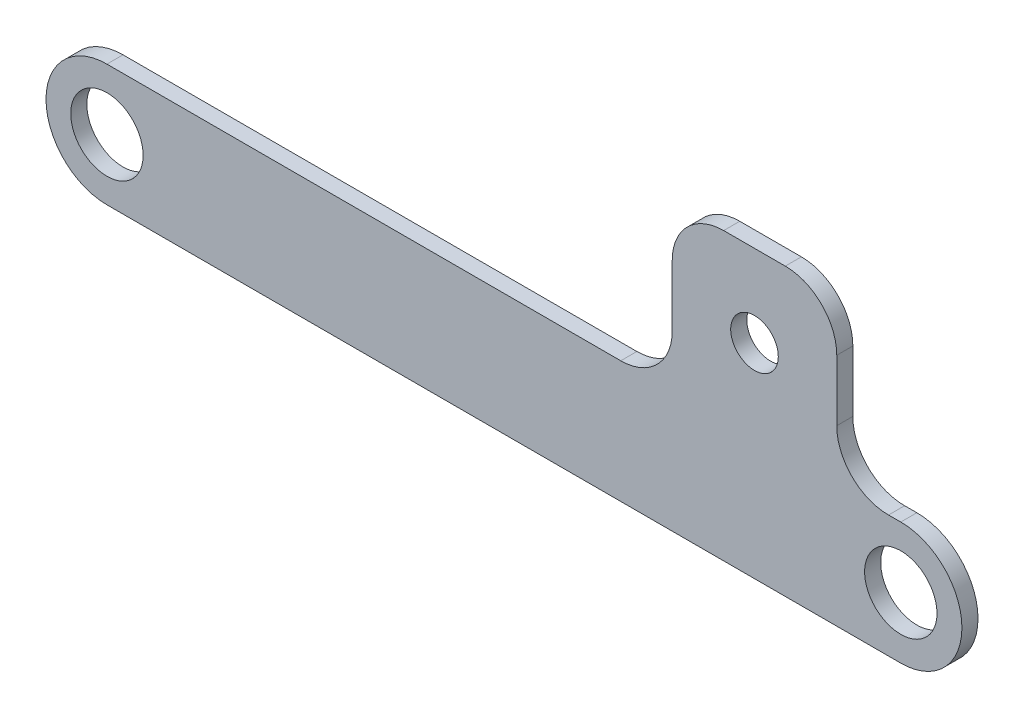
ISO-10303-21;
HEADER;
FILE_DESCRIPTION(('STEP AP214'),'2;1');
FILE_NAME('part.step','',(''),(''),'','','');
FILE_SCHEMA(('AUTOMOTIVE_DESIGN { 1 0 10303 214 1 1 1 1 }'));
ENDSEC;
DATA;
#1=APPLICATION_CONTEXT('core data for automotive mechanical design processes');
#2=APPLICATION_PROTOCOL_DEFINITION('international standard','automotive_design',2000,#1);
#3=PRODUCT_CONTEXT('',#1,'mechanical');
#4=PRODUCT('Part','Part','',(#3));
#5=PRODUCT_RELATED_PRODUCT_CATEGORY('part','',(#4));
#6=PRODUCT_DEFINITION_FORMATION('','',#4);
#7=PRODUCT_DEFINITION_CONTEXT('part definition',#1,'design');
#8=PRODUCT_DEFINITION('design','',#6,#7);
#9=PRODUCT_DEFINITION_SHAPE('','',#8);
#10=(LENGTH_UNIT() NAMED_UNIT(*) SI_UNIT(.MILLI.,.METRE.));
#11=(NAMED_UNIT(*) PLANE_ANGLE_UNIT() SI_UNIT($,.RADIAN.));
#12=(NAMED_UNIT(*) SI_UNIT($,.STERADIAN.) SOLID_ANGLE_UNIT());
#13=UNCERTAINTY_MEASURE_WITH_UNIT(LENGTH_MEASURE(1.E-05),#10,'distance_accuracy_value','');
#14=(GEOMETRIC_REPRESENTATION_CONTEXT(3) GLOBAL_UNCERTAINTY_ASSIGNED_CONTEXT((#13)) GLOBAL_UNIT_ASSIGNED_CONTEXT((#10,
#11,#12)) REPRESENTATION_CONTEXT('',''));
#15=CARTESIAN_POINT('',(0.,0.,0.));
#16=DIRECTION('',(0.,0.,1.));
#17=DIRECTION('',(1.,0.,0.));
#18=AXIS2_PLACEMENT_3D('',#15,#16,#17);
#19=CARTESIAN_POINT('',(0.,0.,6.35));
#20=DIRECTION('',(0.,0.,1.));
#21=DIRECTION('',(1.,0.,0.));
#22=AXIS2_PLACEMENT_3D('',#19,#20,#21);
#23=PLANE('',#22);
#24=CARTESIAN_POINT('',(-57.7648589463848,56.47830208,6.35));
#25=DIRECTION('',(0.,0.,1.));
#26=DIRECTION('',(1.,0.,0.));
#27=AXIS2_PLACEMENT_3D('',#24,#25,#26);
#28=CIRCLE('',#27,9.39800000000001);
#29=CARTESIAN_POINT('',(-48.3668589463848,56.47830208,6.35));
#30=VERTEX_POINT('',#29);
#31=EDGE_CURVE('E418',#30,#30,#28,.T.);
#32=ORIENTED_EDGE('',*,*,#31,.F.);
#33=EDGE_LOOP('',(#32));
#34=FACE_BOUND('',#33,.T.);
#35=DIRECTION('',(-1.,0.,0.));
#36=VECTOR('',#35,1.);
#37=CARTESIAN_POINT('',(-90.24339584,88.82660416,6.35));
#38=LINE('',#37,#36);
#39=CARTESIAN_POINT('',(-45.6063221763848,88.82660416,6.35));
#40=VERTEX_POINT('',#39);
#41=CARTESIAN_POINT('',(-69.92339584,88.82660416,6.35));
#42=VERTEX_POINT('',#41);
#43=EDGE_CURVE('E245',#40,#42,#38,.T.);
#44=ORIENTED_EDGE('',*,*,#43,.T.);
#45=CARTESIAN_POINT('',(-69.92339584,68.50660416,6.35));
#46=DIRECTION('',(0.,0.,1.));
#47=DIRECTION('',(1.,0.,0.));
#48=AXIS2_PLACEMENT_3D('',#45,#46,#47);
#49=CIRCLE('',#48,20.32);
#50=CARTESIAN_POINT('',(-90.24339584,68.50660416,6.35));
#51=VERTEX_POINT('',#50);
#52=EDGE_CURVE('E11',#42,#51,#49,.T.);
#53=ORIENTED_EDGE('',*,*,#52,.T.);
#54=DIRECTION('',(0.,-1.,0.));
#55=VECTOR('',#54,1.);
#56=CARTESIAN_POINT('',(-90.24339584,88.82660416,6.35));
#57=LINE('',#56,#55);
#58=CARTESIAN_POINT('',(-90.24339584,44.30320832,6.35));
#59=VERTEX_POINT('',#58);
#60=EDGE_CURVE('E197',#51,#59,#57,.T.);
#61=ORIENTED_EDGE('',*,*,#60,.T.);
#62=CARTESIAN_POINT('',(-110.56339584,44.30320832,6.35));
#63=DIRECTION('',(0.,0.,1.));
#64=DIRECTION('',(1.,0.,0.));
#65=AXIS2_PLACEMENT_3D('',#62,#63,#64);
#66=CIRCLE('',#65,20.32);
#67=CARTESIAN_POINT('',(-110.56339584,23.98320832,6.35));
#68=VERTEX_POINT('',#67);
#69=EDGE_CURVE('E170',#59,#68,#66,.F.);
#70=ORIENTED_EDGE('',*,*,#69,.T.);
#71=DIRECTION('',(-1.,0.,0.));
#72=VECTOR('',#71,1.);
#73=CARTESIAN_POINT('',(-90.24339584,23.98320832,6.35));
#74=LINE('',#73,#72);
#75=CARTESIAN_POINT('',(-313.436,23.98320832,6.35));
#76=VERTEX_POINT('',#75);
#77=EDGE_CURVE('E248',#68,#76,#74,.T.);
#78=ORIENTED_EDGE('',*,*,#77,.T.);
#79=CARTESIAN_POINT('',(-313.436,-0.0733958400000374,6.35));
#80=DIRECTION('',(0.,0.,1.));
#81=DIRECTION('',(-1.,0.,0.));
#82=AXIS2_PLACEMENT_3D('',#79,#80,#81);
#83=CIRCLE('',#82,24.05660416);
#84=CARTESIAN_POINT('',(-313.436,-24.13,6.35));
#85=VERTEX_POINT('',#84);
#86=EDGE_CURVE('E252',#76,#85,#83,.T.);
#87=ORIENTED_EDGE('',*,*,#86,.T.);
#88=DIRECTION('',(1.,0.,0.));
#89=VECTOR('',#88,1.);
#90=CARTESIAN_POINT('',(0.,-24.13,6.35));
#91=LINE('',#90,#89);
#92=CARTESIAN_POINT('',(0.,-24.13,6.35));
#93=VERTEX_POINT('',#92);
#94=EDGE_CURVE('E145',#85,#93,#91,.T.);
#95=ORIENTED_EDGE('',*,*,#94,.T.);
#96=CARTESIAN_POINT('',(0.,0.,6.35));
#97=DIRECTION('',(0.,0.,1.));
#98=DIRECTION('',(1.,0.,0.));
#99=AXIS2_PLACEMENT_3D('',#96,#97,#98);
#100=CIRCLE('',#99,24.13);
#101=CARTESIAN_POINT('',(-1.74409034865255E-13,24.13,6.35));
#102=VERTEX_POINT('',#101);
#103=EDGE_CURVE('E140',#93,#102,#100,.T.);
#104=ORIENTED_EDGE('',*,*,#103,.T.);
#105=DIRECTION('',(-0.999983150361978,-0.00580508330113796,0.));
#106=VECTOR('',#105,1.);
#107=CARTESIAN_POINT('',(-25.2863221763848,23.98320832,6.35));
#108=LINE('',#107,#106);
#109=CARTESIAN_POINT('',(-4.8483628837057,24.1018543753424,6.35));
#110=VERTEX_POINT('',#109);
#111=EDGE_CURVE('E128',#102,#110,#108,.T.);
#112=ORIENTED_EDGE('',*,*,#111,.T.);
#113=CARTESIAN_POINT('',(-4.96632217638484,44.4215119906978,6.35));
#114=DIRECTION('',(0.,0.,1.));
#115=DIRECTION('',(1.,0.,0.));
#116=AXIS2_PLACEMENT_3D('',#113,#114,#115);
#117=CIRCLE('',#116,20.32);
#118=CARTESIAN_POINT('',(-25.2863221763848,44.4215119906978,6.35));
#119=VERTEX_POINT('',#118);
#120=EDGE_CURVE('E178',#110,#119,#117,.F.);
#121=ORIENTED_EDGE('',*,*,#120,.T.);
#122=DIRECTION('',(0.,1.,0.));
#123=VECTOR('',#122,1.);
#124=CARTESIAN_POINT('',(-25.2863221763848,88.82660416,6.35));
#125=LINE('',#124,#123);
#126=CARTESIAN_POINT('',(-25.2863221763848,68.50660416,6.35));
#127=VERTEX_POINT('',#126);
#128=EDGE_CURVE('E139',#119,#127,#125,.T.);
#129=ORIENTED_EDGE('',*,*,#128,.T.);
#130=CARTESIAN_POINT('',(-45.6063221763848,68.50660416,6.35));
#131=DIRECTION('',(0.,0.,1.));
#132=DIRECTION('',(1.,0.,0.));
#133=AXIS2_PLACEMENT_3D('',#130,#131,#132);
#134=CIRCLE('',#133,20.32);
#135=EDGE_CURVE('E187',#127,#40,#134,.T.);
#136=ORIENTED_EDGE('',*,*,#135,.T.);
#137=EDGE_LOOP('',(#44,#53,#61,#70,#78,#87,#95,#104,#112,#121,#129,#136));
#138=FACE_BOUND('',#137,.T.);
#139=CARTESIAN_POINT('',(-313.436,-0.0733958400000374,6.35));
#140=DIRECTION('',(0.,0.,1.));
#141=DIRECTION('',(1.,0.,0.));
#142=AXIS2_PLACEMENT_3D('',#139,#140,#141);
#143=CIRCLE('',#142,14.2875);
#144=CARTESIAN_POINT('',(-299.1485,-0.0733958400000374,6.35));
#145=VERTEX_POINT('',#144);
#146=EDGE_CURVE('E225',#145,#145,#143,.T.);
#147=ORIENTED_EDGE('',*,*,#146,.F.);
#148=EDGE_LOOP('',(#147));
#149=FACE_BOUND('',#148,.T.);
#150=CARTESIAN_POINT('',(0.,0.,6.35));
#151=DIRECTION('',(0.,0.,1.));
#152=DIRECTION('',(1.,0.,0.));
#153=AXIS2_PLACEMENT_3D('',#150,#151,#152);
#154=CIRCLE('',#153,14.2875);
#155=CARTESIAN_POINT('',(14.2875,0.,6.35));
#156=VERTEX_POINT('',#155);
#157=EDGE_CURVE('E409',#156,#156,#154,.T.);
#158=ORIENTED_EDGE('',*,*,#157,.F.);
#159=EDGE_LOOP('',(#158));
#160=FACE_BOUND('',#159,.T.);
#161=ADVANCED_FACE('F39',(#34,#138,#149,#160),#23,.T.);
#162=CARTESIAN_POINT('',(0.,0.,0.));
#163=DIRECTION('',(0.,0.,1.));
#164=DIRECTION('',(1.,0.,0.));
#165=AXIS2_PLACEMENT_3D('',#162,#163,#164);
#166=PLANE('',#165);
#167=DIRECTION('',(0.,-1.,0.));
#168=VECTOR('',#167,1.);
#169=CARTESIAN_POINT('',(-90.24339584,88.82660416,0.));
#170=LINE('',#169,#168);
#171=CARTESIAN_POINT('',(-90.24339584,68.50660416,0.));
#172=VERTEX_POINT('',#171);
#173=CARTESIAN_POINT('',(-90.24339584,44.30320832,0.));
#174=VERTEX_POINT('',#173);
#175=EDGE_CURVE('E196',#172,#174,#170,.T.);
#176=ORIENTED_EDGE('',*,*,#175,.F.);
#177=CARTESIAN_POINT('',(-69.92339584,68.50660416,0.));
#178=DIRECTION('',(0.,0.,1.));
#179=DIRECTION('',(1.,0.,0.));
#180=AXIS2_PLACEMENT_3D('',#177,#178,#179);
#181=CIRCLE('',#180,20.32);
#182=CARTESIAN_POINT('',(-69.92339584,88.82660416,0.));
#183=VERTEX_POINT('',#182);
#184=EDGE_CURVE('E61',#172,#183,#181,.F.);
#185=ORIENTED_EDGE('',*,*,#184,.T.);
#186=DIRECTION('',(-1.,0.,0.));
#187=VECTOR('',#186,1.);
#188=CARTESIAN_POINT('',(-90.24339584,88.82660416,0.));
#189=LINE('',#188,#187);
#190=CARTESIAN_POINT('',(-45.6063221763848,88.82660416,0.));
#191=VERTEX_POINT('',#190);
#192=EDGE_CURVE('E205',#191,#183,#189,.T.);
#193=ORIENTED_EDGE('',*,*,#192,.F.);
#194=CARTESIAN_POINT('',(-45.6063221763848,68.50660416,0.));
#195=DIRECTION('',(0.,0.,1.));
#196=DIRECTION('',(1.,0.,0.));
#197=AXIS2_PLACEMENT_3D('',#194,#195,#196);
#198=CIRCLE('',#197,20.32);
#199=CARTESIAN_POINT('',(-25.2863221763848,68.50660416,0.));
#200=VERTEX_POINT('',#199);
#201=EDGE_CURVE('E183',#191,#200,#198,.F.);
#202=ORIENTED_EDGE('',*,*,#201,.T.);
#203=DIRECTION('',(0.,1.,0.));
#204=VECTOR('',#203,1.);
#205=CARTESIAN_POINT('',(-25.2863221763848,88.82660416,0.));
#206=LINE('',#205,#204);
#207=CARTESIAN_POINT('',(-25.2863221763848,44.4215119906978,0.));
#208=VERTEX_POINT('',#207);
#209=EDGE_CURVE('E209',#208,#200,#206,.T.);
#210=ORIENTED_EDGE('',*,*,#209,.F.);
#211=CARTESIAN_POINT('',(-4.96632217638484,44.4215119906978,0.));
#212=DIRECTION('',(0.,0.,1.));
#213=DIRECTION('',(1.,0.,0.));
#214=AXIS2_PLACEMENT_3D('',#211,#212,#213);
#215=CIRCLE('',#214,20.32);
#216=CARTESIAN_POINT('',(-4.8483628837057,24.1018543753424,0.));
#217=VERTEX_POINT('',#216);
#218=EDGE_CURVE('E176',#208,#217,#215,.T.);
#219=ORIENTED_EDGE('',*,*,#218,.T.);
#220=DIRECTION('',(-0.999983150361978,-0.00580508330113796,0.));
#221=VECTOR('',#220,1.);
#222=CARTESIAN_POINT('',(-25.2863221763848,23.98320832,0.));
#223=LINE('',#222,#221);
#224=CARTESIAN_POINT('',(-1.74409034865255E-13,24.13,0.));
#225=VERTEX_POINT('',#224);
#226=EDGE_CURVE('E224',#225,#217,#223,.T.);
#227=ORIENTED_EDGE('',*,*,#226,.F.);
#228=CARTESIAN_POINT('',(0.,0.,0.));
#229=DIRECTION('',(0.,0.,1.));
#230=DIRECTION('',(1.,0.,0.));
#231=AXIS2_PLACEMENT_3D('',#228,#229,#230);
#232=CIRCLE('',#231,24.13);
#233=CARTESIAN_POINT('',(0.,-24.13,0.));
#234=VERTEX_POINT('',#233);
#235=EDGE_CURVE('E153',#234,#225,#232,.T.);
#236=ORIENTED_EDGE('',*,*,#235,.F.);
#237=DIRECTION('',(1.,0.,0.));
#238=VECTOR('',#237,1.);
#239=CARTESIAN_POINT('',(0.,-24.13,0.));
#240=LINE('',#239,#238);
#241=CARTESIAN_POINT('',(-313.436,-24.13,0.));
#242=VERTEX_POINT('',#241);
#243=EDGE_CURVE('E149',#242,#234,#240,.T.);
#244=ORIENTED_EDGE('',*,*,#243,.F.);
#245=CARTESIAN_POINT('',(-313.436,-0.0733958400000374,0.));
#246=DIRECTION('',(0.,0.,1.));
#247=DIRECTION('',(-1.,0.,0.));
#248=AXIS2_PLACEMENT_3D('',#245,#246,#247);
#249=CIRCLE('',#248,24.05660416);
#250=CARTESIAN_POINT('',(-313.436,23.98320832,0.));
#251=VERTEX_POINT('',#250);
#252=EDGE_CURVE('E207',#251,#242,#249,.T.);
#253=ORIENTED_EDGE('',*,*,#252,.F.);
#254=DIRECTION('',(-1.,0.,0.));
#255=VECTOR('',#254,1.);
#256=CARTESIAN_POINT('',(-90.24339584,23.98320832,0.));
#257=LINE('',#256,#255);
#258=CARTESIAN_POINT('',(-110.56339584,23.98320832,0.));
#259=VERTEX_POINT('',#258);
#260=EDGE_CURVE('E204',#259,#251,#257,.T.);
#261=ORIENTED_EDGE('',*,*,#260,.F.);
#262=CARTESIAN_POINT('',(-110.56339584,44.30320832,0.));
#263=DIRECTION('',(0.,0.,1.));
#264=DIRECTION('',(1.,0.,0.));
#265=AXIS2_PLACEMENT_3D('',#262,#263,#264);
#266=CIRCLE('',#265,20.32);
#267=EDGE_CURVE('E167',#259,#174,#266,.T.);
#268=ORIENTED_EDGE('',*,*,#267,.T.);
#269=EDGE_LOOP('',(#176,#185,#193,#202,#210,#219,#227,#236,#244,#253,#261,#268));
#270=FACE_BOUND('',#269,.T.);
#271=CARTESIAN_POINT('',(-313.436,-0.0733958400000374,0.));
#272=DIRECTION('',(0.,0.,1.));
#273=DIRECTION('',(1.,0.,0.));
#274=AXIS2_PLACEMENT_3D('',#271,#272,#273);
#275=CIRCLE('',#274,14.2875);
#276=CARTESIAN_POINT('',(-299.1485,-0.0733958400000374,0.));
#277=VERTEX_POINT('',#276);
#278=EDGE_CURVE('E229',#277,#277,#275,.T.);
#279=ORIENTED_EDGE('',*,*,#278,.T.);
#280=EDGE_LOOP('',(#279));
#281=FACE_BOUND('',#280,.T.);
#282=CARTESIAN_POINT('',(-57.7648589463848,56.47830208,0.));
#283=DIRECTION('',(0.,0.,1.));
#284=DIRECTION('',(1.,0.,0.));
#285=AXIS2_PLACEMENT_3D('',#282,#283,#284);
#286=CIRCLE('',#285,9.39800000000001);
#287=CARTESIAN_POINT('',(-48.3668589463848,56.47830208,0.));
#288=VERTEX_POINT('',#287);
#289=EDGE_CURVE('E415',#288,#288,#286,.T.);
#290=ORIENTED_EDGE('',*,*,#289,.T.);
#291=EDGE_LOOP('',(#290));
#292=FACE_BOUND('',#291,.T.);
#293=CARTESIAN_POINT('',(0.,0.,0.));
#294=DIRECTION('',(0.,0.,1.));
#295=DIRECTION('',(1.,0.,0.));
#296=AXIS2_PLACEMENT_3D('',#293,#294,#295);
#297=CIRCLE('',#296,14.2875);
#298=CARTESIAN_POINT('',(14.2875,0.,0.));
#299=VERTEX_POINT('',#298);
#300=EDGE_CURVE('E412',#299,#299,#297,.T.);
#301=ORIENTED_EDGE('',*,*,#300,.T.);
#302=EDGE_LOOP('',(#301));
#303=FACE_BOUND('',#302,.T.);
#304=ADVANCED_FACE('F200',(#270,#281,#292,#303),#166,.F.);
#305=CARTESIAN_POINT('',(0.,0.,6.35));
#306=DIRECTION('',(0.,0.,-1.));
#307=DIRECTION('',(-1.,0.,0.));
#308=AXIS2_PLACEMENT_3D('',#305,#306,#307);
#309=CYLINDRICAL_SURFACE('',#308,24.13);
#310=ORIENTED_EDGE('',*,*,#235,.T.);
#311=DIRECTION('',(0.,0.,-1.));
#312=VECTOR('',#311,1.);
#313=CARTESIAN_POINT('',(-1.74409034865255E-13,24.13,6.35));
#314=LINE('',#313,#312);
#315=EDGE_CURVE('E133',#102,#225,#314,.T.);
#316=ORIENTED_EDGE('',*,*,#315,.F.);
#317=ORIENTED_EDGE('',*,*,#103,.F.);
#318=DIRECTION('',(0.,0.,-1.));
#319=VECTOR('',#318,1.);
#320=CARTESIAN_POINT('',(0.,-24.13,6.35));
#321=LINE('',#320,#319);
#322=EDGE_CURVE('E215',#93,#234,#321,.T.);
#323=ORIENTED_EDGE('',*,*,#322,.T.);
#324=EDGE_LOOP('',(#310,#316,#317,#323));
#325=FACE_BOUND('',#324,.T.);
#326=ADVANCED_FACE('F151',(#325),#309,.T.);
#327=CARTESIAN_POINT('',(-25.2863221763848,23.98320832,6.35));
#328=DIRECTION('',(0.00580508330113795,-0.999983150361978,0.));
#329=DIRECTION('',(0.999983150361978,0.00580508330113795,0.));
#330=AXIS2_PLACEMENT_3D('',#327,#328,#329);
#331=PLANE('',#330);
#332=ORIENTED_EDGE('',*,*,#226,.T.);
#333=DIRECTION('',(0.,0.,-1.));
#334=VECTOR('',#333,1.);
#335=CARTESIAN_POINT('',(-4.84836288370571,24.1018543753424,6.35));
#336=LINE('',#335,#334);
#337=EDGE_CURVE('E136',#217,#110,#336,.F.);
#338=ORIENTED_EDGE('',*,*,#337,.T.);
#339=ORIENTED_EDGE('',*,*,#111,.F.);
#340=ORIENTED_EDGE('',*,*,#315,.T.);
#341=EDGE_LOOP('',(#332,#338,#339,#340));
#342=FACE_BOUND('',#341,.T.);
#343=ADVANCED_FACE('F131',(#342),#331,.F.);
#344=CARTESIAN_POINT('',(-25.2863221763848,88.82660416,6.35));
#345=DIRECTION('',(-1.,0.,0.));
#346=DIRECTION('',(0.,-1.,0.));
#347=AXIS2_PLACEMENT_3D('',#344,#345,#346);
#348=PLANE('',#347);
#349=ORIENTED_EDGE('',*,*,#209,.T.);
#350=DIRECTION('',(0.,0.,-1.));
#351=VECTOR('',#350,1.);
#352=CARTESIAN_POINT('',(-25.2863221763848,68.50660416,6.35));
#353=LINE('',#352,#351);
#354=EDGE_CURVE('E185',#200,#127,#353,.F.);
#355=ORIENTED_EDGE('',*,*,#354,.T.);
#356=ORIENTED_EDGE('',*,*,#128,.F.);
#357=DIRECTION('',(0.,0.,-1.));
#358=VECTOR('',#357,1.);
#359=CARTESIAN_POINT('',(-25.2863221763848,44.4215119906978,0.));
#360=LINE('',#359,#358);
#361=EDGE_CURVE('E172',#119,#208,#360,.T.);
#362=ORIENTED_EDGE('',*,*,#361,.T.);
#363=EDGE_LOOP('',(#349,#355,#356,#362));
#364=FACE_BOUND('',#363,.T.);
#365=ADVANCED_FACE('F237',(#364),#348,.F.);
#366=CARTESIAN_POINT('',(-90.24339584,88.82660416,6.35));
#367=DIRECTION('',(0.,-1.,0.));
#368=DIRECTION('',(0.,0.,-1.));
#369=AXIS2_PLACEMENT_3D('',#366,#367,#368);
#370=PLANE('',#369);
#371=ORIENTED_EDGE('',*,*,#192,.T.);
#372=DIRECTION('',(0.,0.,-1.));
#373=VECTOR('',#372,1.);
#374=CARTESIAN_POINT('',(-69.92339584,88.82660416,6.35));
#375=LINE('',#374,#373);
#376=EDGE_CURVE('E47',#183,#42,#375,.F.);
#377=ORIENTED_EDGE('',*,*,#376,.T.);
#378=ORIENTED_EDGE('',*,*,#43,.F.);
#379=DIRECTION('',(0.,0.,-1.));
#380=VECTOR('',#379,1.);
#381=CARTESIAN_POINT('',(-45.6063221763848,88.82660416,6.35));
#382=LINE('',#381,#380);
#383=EDGE_CURVE('E180',#40,#191,#382,.T.);
#384=ORIENTED_EDGE('',*,*,#383,.T.);
#385=EDGE_LOOP('',(#371,#377,#378,#384));
#386=FACE_BOUND('',#385,.T.);
#387=ADVANCED_FACE('F246',(#386),#370,.F.);
#388=CARTESIAN_POINT('',(-90.24339584,88.82660416,6.35));
#389=DIRECTION('',(1.,0.,0.));
#390=DIRECTION('',(0.,1.,0.));
#391=AXIS2_PLACEMENT_3D('',#388,#389,#390);
#392=PLANE('',#391);
#393=ORIENTED_EDGE('',*,*,#60,.F.);
#394=DIRECTION('',(0.,0.,-1.));
#395=VECTOR('',#394,1.);
#396=CARTESIAN_POINT('',(-90.24339584,68.50660416,6.35));
#397=LINE('',#396,#395);
#398=EDGE_CURVE('E189',#51,#172,#397,.T.);
#399=ORIENTED_EDGE('',*,*,#398,.T.);
#400=ORIENTED_EDGE('',*,*,#175,.T.);
#401=DIRECTION('',(0.,0.,-1.));
#402=VECTOR('',#401,1.);
#403=CARTESIAN_POINT('',(-90.24339584,44.30320832,6.35));
#404=LINE('',#403,#402);
#405=EDGE_CURVE('E158',#174,#59,#404,.F.);
#406=ORIENTED_EDGE('',*,*,#405,.T.);
#407=EDGE_LOOP('',(#393,#399,#400,#406));
#408=FACE_BOUND('',#407,.T.);
#409=ADVANCED_FACE('F195',(#408),#392,.F.);
#410=CARTESIAN_POINT('',(-90.24339584,23.98320832,6.35));
#411=DIRECTION('',(0.,-1.,0.));
#412=DIRECTION('',(1.,0.,0.));
#413=AXIS2_PLACEMENT_3D('',#410,#411,#412);
#414=PLANE('',#413);
#415=ORIENTED_EDGE('',*,*,#77,.F.);
#416=DIRECTION('',(0.,0.,-1.));
#417=VECTOR('',#416,1.);
#418=CARTESIAN_POINT('',(-110.56339584,23.98320832,0.));
#419=LINE('',#418,#417);
#420=EDGE_CURVE('E154',#68,#259,#419,.T.);
#421=ORIENTED_EDGE('',*,*,#420,.T.);
#422=ORIENTED_EDGE('',*,*,#260,.T.);
#423=DIRECTION('',(0.,0.,-1.));
#424=VECTOR('',#423,1.);
#425=CARTESIAN_POINT('',(-313.436,23.98320832,6.35));
#426=LINE('',#425,#424);
#427=EDGE_CURVE('E155',#76,#251,#426,.T.);
#428=ORIENTED_EDGE('',*,*,#427,.F.);
#429=EDGE_LOOP('',(#415,#421,#422,#428));
#430=FACE_BOUND('',#429,.T.);
#431=ADVANCED_FACE('F257',(#430),#414,.F.);
#432=CARTESIAN_POINT('',(-313.436,-0.0733958400000374,6.35));
#433=DIRECTION('',(0.,0.,-1.));
#434=DIRECTION('',(-1.,0.,0.));
#435=AXIS2_PLACEMENT_3D('',#432,#433,#434);
#436=CYLINDRICAL_SURFACE('',#435,24.05660416);
#437=ORIENTED_EDGE('',*,*,#252,.T.);
#438=DIRECTION('',(0.,0.,-1.));
#439=VECTOR('',#438,1.);
#440=CARTESIAN_POINT('',(-313.436,-24.13,6.35));
#441=LINE('',#440,#439);
#442=EDGE_CURVE('E161',#85,#242,#441,.T.);
#443=ORIENTED_EDGE('',*,*,#442,.F.);
#444=ORIENTED_EDGE('',*,*,#86,.F.);
#445=ORIENTED_EDGE('',*,*,#427,.T.);
#446=EDGE_LOOP('',(#437,#443,#444,#445));
#447=FACE_BOUND('',#446,.T.);
#448=ADVANCED_FACE('F255',(#447),#436,.T.);
#449=CARTESIAN_POINT('',(0.,-24.13,6.35));
#450=DIRECTION('',(0.,1.,0.));
#451=DIRECTION('',(-1.,0.,0.));
#452=AXIS2_PLACEMENT_3D('',#449,#450,#451);
#453=PLANE('',#452);
#454=ORIENTED_EDGE('',*,*,#243,.T.);
#455=ORIENTED_EDGE('',*,*,#322,.F.);
#456=ORIENTED_EDGE('',*,*,#94,.F.);
#457=ORIENTED_EDGE('',*,*,#442,.T.);
#458=EDGE_LOOP('',(#454,#455,#456,#457));
#459=FACE_BOUND('',#458,.T.);
#460=ADVANCED_FACE('F220',(#459),#453,.F.);
#461=CARTESIAN_POINT('',(-313.436,-0.0733958400000374,6.35));
#462=DIRECTION('',(0.,0.,-1.));
#463=DIRECTION('',(-1.,0.,0.));
#464=AXIS2_PLACEMENT_3D('',#461,#462,#463);
#465=CYLINDRICAL_SURFACE('',#464,14.2875);
#466=ORIENTED_EDGE('',*,*,#146,.T.);
#467=EDGE_LOOP('',(#466));
#468=FACE_BOUND('',#467,.T.);
#469=ORIENTED_EDGE('',*,*,#278,.F.);
#470=EDGE_LOOP('',(#469));
#471=FACE_BOUND('',#470,.T.);
#472=ADVANCED_FACE('F276',(#468,#471),#465,.F.);
#473=CARTESIAN_POINT('',(-57.7648589463848,56.47830208,6.35));
#474=DIRECTION('',(0.,0.,-1.));
#475=DIRECTION('',(-1.,0.,0.));
#476=AXIS2_PLACEMENT_3D('',#473,#474,#475);
#477=CYLINDRICAL_SURFACE('',#476,9.39800000000001);
#478=ORIENTED_EDGE('',*,*,#31,.T.);
#479=EDGE_LOOP('',(#478));
#480=FACE_BOUND('',#479,.T.);
#481=ORIENTED_EDGE('',*,*,#289,.F.);
#482=EDGE_LOOP('',(#481));
#483=FACE_BOUND('',#482,.T.);
#484=ADVANCED_FACE('F362',(#480,#483),#477,.F.);
#485=CARTESIAN_POINT('',(0.,0.,6.35));
#486=DIRECTION('',(0.,0.,-1.));
#487=DIRECTION('',(-1.,0.,0.));
#488=AXIS2_PLACEMENT_3D('',#485,#486,#487);
#489=CYLINDRICAL_SURFACE('',#488,14.2875);
#490=ORIENTED_EDGE('',*,*,#157,.T.);
#491=EDGE_LOOP('',(#490));
#492=FACE_BOUND('',#491,.T.);
#493=ORIENTED_EDGE('',*,*,#300,.F.);
#494=EDGE_LOOP('',(#493));
#495=FACE_BOUND('',#494,.T.);
#496=ADVANCED_FACE('F297',(#492,#495),#489,.F.);
#497=CARTESIAN_POINT('',(-110.56339584,44.30320832,6.35));
#498=DIRECTION('',(0.,0.,1.));
#499=DIRECTION('',(1.,0.,0.));
#500=AXIS2_PLACEMENT_3D('',#497,#498,#499);
#501=CYLINDRICAL_SURFACE('',#500,20.32);
#502=ORIENTED_EDGE('',*,*,#69,.F.);
#503=ORIENTED_EDGE('',*,*,#405,.F.);
#504=ORIENTED_EDGE('',*,*,#267,.F.);
#505=ORIENTED_EDGE('',*,*,#420,.F.);
#506=EDGE_LOOP('',(#502,#503,#504,#505));
#507=FACE_BOUND('',#506,.T.);
#508=ADVANCED_FACE('F261',(#507),#501,.F.);
#509=CARTESIAN_POINT('',(-4.96632217638484,44.4215119906978,6.35));
#510=DIRECTION('',(0.,0.,1.));
#511=DIRECTION('',(1.,0.,0.));
#512=AXIS2_PLACEMENT_3D('',#509,#510,#511);
#513=CYLINDRICAL_SURFACE('',#512,20.32);
#514=ORIENTED_EDGE('',*,*,#120,.F.);
#515=ORIENTED_EDGE('',*,*,#337,.F.);
#516=ORIENTED_EDGE('',*,*,#218,.F.);
#517=ORIENTED_EDGE('',*,*,#361,.F.);
#518=EDGE_LOOP('',(#514,#515,#516,#517));
#519=FACE_BOUND('',#518,.T.);
#520=ADVANCED_FACE('F266',(#519),#513,.F.);
#521=CARTESIAN_POINT('',(-45.6063221763848,68.50660416,6.35));
#522=DIRECTION('',(0.,0.,-1.));
#523=DIRECTION('',(-1.,0.,0.));
#524=AXIS2_PLACEMENT_3D('',#521,#522,#523);
#525=CYLINDRICAL_SURFACE('',#524,20.32);
#526=ORIENTED_EDGE('',*,*,#135,.F.);
#527=ORIENTED_EDGE('',*,*,#354,.F.);
#528=ORIENTED_EDGE('',*,*,#201,.F.);
#529=ORIENTED_EDGE('',*,*,#383,.F.);
#530=EDGE_LOOP('',(#526,#527,#528,#529));
#531=FACE_BOUND('',#530,.T.);
#532=ADVANCED_FACE('F243',(#531),#525,.T.);
#533=CARTESIAN_POINT('',(-69.92339584,68.50660416,6.35));
#534=DIRECTION('',(0.,0.,-1.));
#535=DIRECTION('',(-1.,0.,0.));
#536=AXIS2_PLACEMENT_3D('',#533,#534,#535);
#537=CYLINDRICAL_SURFACE('',#536,20.32);
#538=ORIENTED_EDGE('',*,*,#52,.F.);
#539=ORIENTED_EDGE('',*,*,#376,.F.);
#540=ORIENTED_EDGE('',*,*,#184,.F.);
#541=ORIENTED_EDGE('',*,*,#398,.F.);
#542=EDGE_LOOP('',(#538,#539,#540,#541));
#543=FACE_BOUND('',#542,.T.);
#544=ADVANCED_FACE('F41',(#543),#537,.T.);
#545=CLOSED_SHELL('',(#161,#304,#326,#343,#365,#387,#409,#431,#448,#460,#472,#484,#496,#508,
#520,#532,#544));
#546=MANIFOLD_SOLID_BREP('B2',#545);
#547=ADVANCED_BREP_SHAPE_REPRESENTATION('',(#18,#546),#14);
#548=SHAPE_DEFINITION_REPRESENTATION(#9,#547);
ENDSEC;
END-ISO-10303-21;
